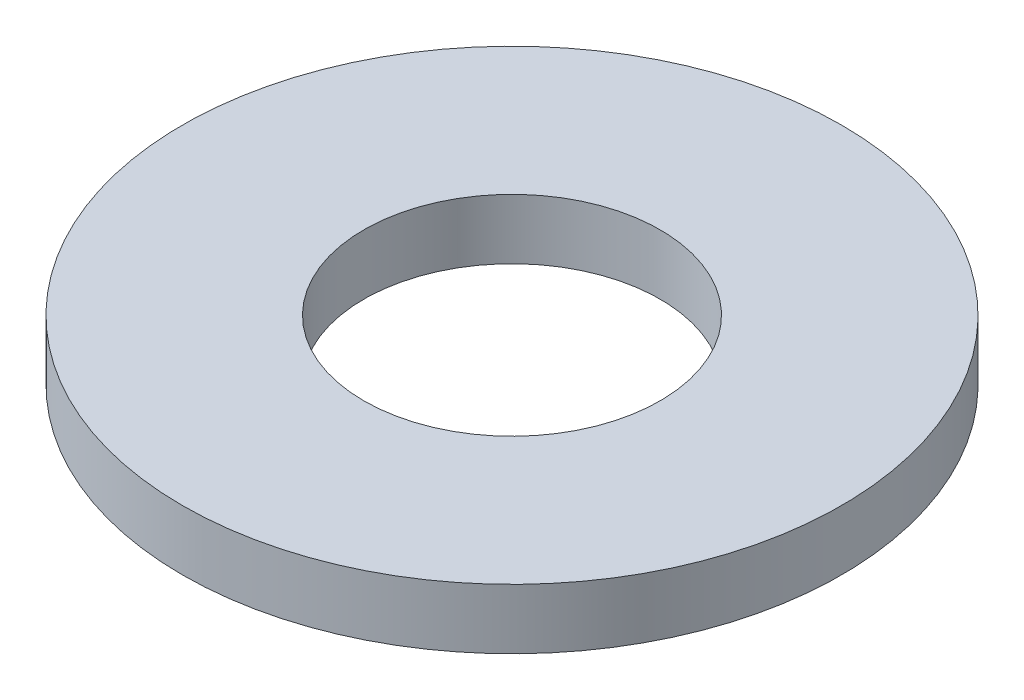
ISO-10303-21;
HEADER;
FILE_DESCRIPTION(('STEP AP214'),'2;1');
FILE_NAME('part.step','',(''),(''),'','','');
FILE_SCHEMA(('AUTOMOTIVE_DESIGN { 1 0 10303 214 1 1 1 1 }'));
ENDSEC;
DATA;
#1=APPLICATION_CONTEXT('core data for automotive mechanical design processes');
#2=APPLICATION_PROTOCOL_DEFINITION('international standard','automotive_design',2000,#1);
#3=PRODUCT_CONTEXT('',#1,'mechanical');
#4=PRODUCT('Part','Part','',(#3));
#5=PRODUCT_RELATED_PRODUCT_CATEGORY('part','',(#4));
#6=PRODUCT_DEFINITION_FORMATION('','',#4);
#7=PRODUCT_DEFINITION_CONTEXT('part definition',#1,'design');
#8=PRODUCT_DEFINITION('design','',#6,#7);
#9=PRODUCT_DEFINITION_SHAPE('','',#8);
#10=(LENGTH_UNIT() NAMED_UNIT(*) SI_UNIT(.MILLI.,.METRE.));
#11=(NAMED_UNIT(*) PLANE_ANGLE_UNIT() SI_UNIT($,.RADIAN.));
#12=(NAMED_UNIT(*) SI_UNIT($,.STERADIAN.) SOLID_ANGLE_UNIT());
#13=UNCERTAINTY_MEASURE_WITH_UNIT(LENGTH_MEASURE(1.E-05),#10,'distance_accuracy_value','');
#14=(GEOMETRIC_REPRESENTATION_CONTEXT(3) GLOBAL_UNCERTAINTY_ASSIGNED_CONTEXT((#13)) GLOBAL_UNIT_ASSIGNED_CONTEXT((#10,
#11,#12)) REPRESENTATION_CONTEXT('',''));
#15=CARTESIAN_POINT('',(0.,0.,0.));
#16=DIRECTION('',(0.,0.,1.));
#17=DIRECTION('',(1.,0.,0.));
#18=AXIS2_PLACEMENT_3D('',#15,#16,#17);
#19=CARTESIAN_POINT('',(0.,1.4478,0.));
#20=DIRECTION('',(0.,-1.,0.));
#21=DIRECTION('',(0.,0.,-1.));
#22=AXIS2_PLACEMENT_3D('',#19,#20,#21);
#23=CYLINDRICAL_SURFACE('',#22,7.9375);
#24=CARTESIAN_POINT('',(0.,1.4478,0.));
#25=DIRECTION('',(0.,1.,0.));
#26=DIRECTION('',(0.,0.,1.));
#27=AXIS2_PLACEMENT_3D('',#24,#25,#26);
#28=CIRCLE('',#27,7.9375);
#29=CARTESIAN_POINT('',(0.,1.4478,7.9375));
#30=VERTEX_POINT('',#29);
#31=EDGE_CURVE('E10',#30,#30,#28,.T.);
#32=ORIENTED_EDGE('',*,*,#31,.F.);
#33=EDGE_LOOP('',(#32));
#34=FACE_BOUND('',#33,.T.);
#35=CARTESIAN_POINT('',(0.,0.,0.));
#36=DIRECTION('',(0.,1.,0.));
#37=DIRECTION('',(0.,0.,1.));
#38=AXIS2_PLACEMENT_3D('',#35,#36,#37);
#39=CIRCLE('',#38,7.9375);
#40=CARTESIAN_POINT('',(0.,0.,7.9375));
#41=VERTEX_POINT('',#40);
#42=EDGE_CURVE('E33',#41,#41,#39,.T.);
#43=ORIENTED_EDGE('',*,*,#42,.T.);
#44=EDGE_LOOP('',(#43));
#45=FACE_BOUND('',#44,.T.);
#46=ADVANCED_FACE('F30',(#34,#45),#23,.T.);
#47=CARTESIAN_POINT('',(0.,1.4478,0.));
#48=DIRECTION('',(0.,1.,0.));
#49=DIRECTION('',(0.,0.,1.));
#50=AXIS2_PLACEMENT_3D('',#47,#48,#49);
#51=PLANE('',#50);
#52=CARTESIAN_POINT('',(0.,1.4478,0.));
#53=DIRECTION('',(0.,1.,0.));
#54=DIRECTION('',(0.,0.,1.));
#55=AXIS2_PLACEMENT_3D('',#52,#53,#54);
#56=CIRCLE('',#55,3.5687);
#57=CARTESIAN_POINT('',(0.,1.4478,3.5687));
#58=VERTEX_POINT('',#57);
#59=EDGE_CURVE('E42',#58,#58,#56,.T.);
#60=ORIENTED_EDGE('',*,*,#59,.F.);
#61=EDGE_LOOP('',(#60));
#62=FACE_BOUND('',#61,.T.);
#63=ORIENTED_EDGE('',*,*,#31,.T.);
#64=EDGE_LOOP('',(#63));
#65=FACE_BOUND('',#64,.T.);
#66=ADVANCED_FACE('F57',(#62,#65),#51,.T.);
#67=CARTESIAN_POINT('',(0.,0.,0.));
#68=DIRECTION('',(0.,1.,0.));
#69=DIRECTION('',(0.,0.,1.));
#70=AXIS2_PLACEMENT_3D('',#67,#68,#69);
#71=PLANE('',#70);
#72=CARTESIAN_POINT('',(0.,0.,0.));
#73=DIRECTION('',(0.,1.,0.));
#74=DIRECTION('',(0.,0.,1.));
#75=AXIS2_PLACEMENT_3D('',#72,#73,#74);
#76=CIRCLE('',#75,3.5687);
#77=CARTESIAN_POINT('',(0.,0.,3.5687));
#78=VERTEX_POINT('',#77);
#79=EDGE_CURVE('E40',#78,#78,#76,.T.);
#80=ORIENTED_EDGE('',*,*,#79,.T.);
#81=EDGE_LOOP('',(#80));
#82=FACE_BOUND('',#81,.T.);
#83=ORIENTED_EDGE('',*,*,#42,.F.);
#84=EDGE_LOOP('',(#83));
#85=FACE_BOUND('',#84,.T.);
#86=ADVANCED_FACE('F48',(#82,#85),#71,.F.);
#87=CARTESIAN_POINT('',(0.,0.,0.));
#88=DIRECTION('',(0.,1.,0.));
#89=DIRECTION('',(0.,0.,1.));
#90=AXIS2_PLACEMENT_3D('',#87,#88,#89);
#91=CYLINDRICAL_SURFACE('',#90,3.5687);
#92=ORIENTED_EDGE('',*,*,#79,.F.);
#93=EDGE_LOOP('',(#92));
#94=FACE_BOUND('',#93,.T.);
#95=ORIENTED_EDGE('',*,*,#59,.T.);
#96=EDGE_LOOP('',(#95));
#97=FACE_BOUND('',#96,.T.);
#98=ADVANCED_FACE('F51',(#94,#97),#91,.F.);
#99=CLOSED_SHELL('',(#46,#66,#86,#98));
#100=MANIFOLD_SOLID_BREP('B2',#99);
#101=ADVANCED_BREP_SHAPE_REPRESENTATION('',(#18,#100),#14);
#102=SHAPE_DEFINITION_REPRESENTATION(#9,#101);
ENDSEC;
END-ISO-10303-21;
